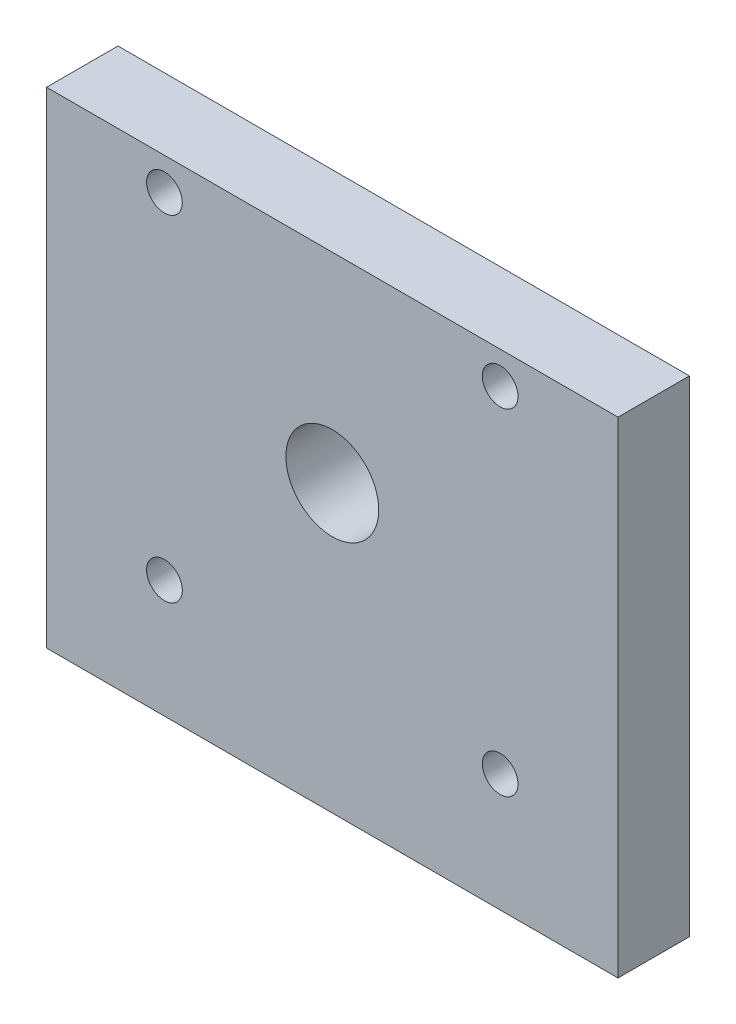
ISO-10303-21;
HEADER;
FILE_DESCRIPTION(('STEP AP214'),'2;1');
FILE_NAME('part.step','',(''),(''),'','','');
FILE_SCHEMA(('AUTOMOTIVE_DESIGN { 1 0 10303 214 1 1 1 1 }'));
ENDSEC;
DATA;
#1=APPLICATION_CONTEXT('core data for automotive mechanical design processes');
#2=APPLICATION_PROTOCOL_DEFINITION('international standard','automotive_design',2000,#1);
#3=PRODUCT_CONTEXT('',#1,'mechanical');
#4=PRODUCT('Part','Part','',(#3));
#5=PRODUCT_RELATED_PRODUCT_CATEGORY('part','',(#4));
#6=PRODUCT_DEFINITION_FORMATION('','',#4);
#7=PRODUCT_DEFINITION_CONTEXT('part definition',#1,'design');
#8=PRODUCT_DEFINITION('design','',#6,#7);
#9=PRODUCT_DEFINITION_SHAPE('','',#8);
#10=(LENGTH_UNIT() NAMED_UNIT(*) SI_UNIT(.MILLI.,.METRE.));
#11=(NAMED_UNIT(*) PLANE_ANGLE_UNIT() SI_UNIT($,.RADIAN.));
#12=(NAMED_UNIT(*) SI_UNIT($,.STERADIAN.) SOLID_ANGLE_UNIT());
#13=UNCERTAINTY_MEASURE_WITH_UNIT(LENGTH_MEASURE(1.E-05),#10,'distance_accuracy_value','');
#14=(GEOMETRIC_REPRESENTATION_CONTEXT(3) GLOBAL_UNCERTAINTY_ASSIGNED_CONTEXT((#13)) GLOBAL_UNIT_ASSIGNED_CONTEXT((#10,
#11,#12)) REPRESENTATION_CONTEXT('',''));
#15=CARTESIAN_POINT('',(0.,0.,0.));
#16=DIRECTION('',(0.,0.,1.));
#17=DIRECTION('',(1.,0.,0.));
#18=AXIS2_PLACEMENT_3D('',#15,#16,#17);
#19=CARTESIAN_POINT('',(0.,0.,10.));
#20=DIRECTION('',(0.,0.,1.));
#21=DIRECTION('',(1.,0.,0.));
#22=AXIS2_PLACEMENT_3D('',#19,#20,#21);
#23=PLANE('',#22);
#24=CARTESIAN_POINT('',(27.448018328344,-26.5684931506849,10.));
#25=DIRECTION('',(0.,0.,1.));
#26=DIRECTION('',(1.,0.,0.));
#27=AXIS2_PLACEMENT_3D('',#24,#25,#26);
#28=CIRCLE('',#27,2.5);
#29=CARTESIAN_POINT('',(29.948018328344,-26.5684931506849,10.));
#30=VERTEX_POINT('',#29);
#31=EDGE_CURVE('E128',#30,#30,#28,.T.);
#32=ORIENTED_EDGE('',*,*,#31,.F.);
#33=EDGE_LOOP('',(#32));
#34=FACE_BOUND('',#33,.T.);
#35=CARTESIAN_POINT('',(-19.5519816716559,20.4315068493151,10.));
#36=DIRECTION('',(0.,0.,1.));
#37=DIRECTION('',(1.,0.,0.));
#38=AXIS2_PLACEMENT_3D('',#35,#36,#37);
#39=CIRCLE('',#38,2.5);
#40=CARTESIAN_POINT('',(-17.0519816716559,20.4315068493151,10.));
#41=VERTEX_POINT('',#40);
#42=EDGE_CURVE('E116',#41,#41,#39,.T.);
#43=ORIENTED_EDGE('',*,*,#42,.F.);
#44=EDGE_LOOP('',(#43));
#45=FACE_BOUND('',#44,.T.);
#46=DIRECTION('',(0.,-1.,0.));
#47=VECTOR('',#46,1.);
#48=CARTESIAN_POINT('',(-36.0519816716559,24.9315068493151,10.));
#49=LINE('',#48,#47);
#50=CARTESIAN_POINT('',(-36.0519816716559,24.9315068493151,10.));
#51=VERTEX_POINT('',#50);
#52=CARTESIAN_POINT('',(-36.0519816716559,-43.0684931506849,10.));
#53=VERTEX_POINT('',#52);
#54=EDGE_CURVE('E86',#51,#53,#49,.T.);
#55=ORIENTED_EDGE('',*,*,#54,.T.);
#56=DIRECTION('',(1.,0.,0.));
#57=VECTOR('',#56,1.);
#58=CARTESIAN_POINT('',(-36.0519816716559,-43.0684931506849,10.));
#59=LINE('',#58,#57);
#60=CARTESIAN_POINT('',(43.9480183283441,-43.0684931506849,10.));
#61=VERTEX_POINT('',#60);
#62=EDGE_CURVE('E81',#53,#61,#59,.T.);
#63=ORIENTED_EDGE('',*,*,#62,.T.);
#64=DIRECTION('',(0.,1.,0.));
#65=VECTOR('',#64,1.);
#66=CARTESIAN_POINT('',(43.9480183283441,24.9315068493151,10.));
#67=LINE('',#66,#65);
#68=CARTESIAN_POINT('',(43.9480183283441,24.9315068493151,10.));
#69=VERTEX_POINT('',#68);
#70=EDGE_CURVE('E84',#61,#69,#67,.T.);
#71=ORIENTED_EDGE('',*,*,#70,.T.);
#72=DIRECTION('',(-1.,0.,0.));
#73=VECTOR('',#72,1.);
#74=CARTESIAN_POINT('',(-36.0519816716559,24.9315068493151,10.));
#75=LINE('',#74,#73);
#76=EDGE_CURVE('E51',#69,#51,#75,.T.);
#77=ORIENTED_EDGE('',*,*,#76,.T.);
#78=EDGE_LOOP('',(#55,#63,#71,#77));
#79=FACE_BOUND('',#78,.T.);
#80=CARTESIAN_POINT('',(3.94801832834409,-3.06849315068491,10.));
#81=DIRECTION('',(0.,0.,1.));
#82=DIRECTION('',(1.,0.,0.));
#83=AXIS2_PLACEMENT_3D('',#80,#81,#82);
#84=CIRCLE('',#83,6.5);
#85=CARTESIAN_POINT('',(10.4480183283441,-3.06849315068491,10.));
#86=VERTEX_POINT('',#85);
#87=EDGE_CURVE('E101',#86,#86,#84,.T.);
#88=ORIENTED_EDGE('',*,*,#87,.F.);
#89=EDGE_LOOP('',(#88));
#90=FACE_BOUND('',#89,.T.);
#91=CARTESIAN_POINT('',(27.448018328344,20.4315068493151,10.));
#92=DIRECTION('',(0.,0.,1.));
#93=DIRECTION('',(-1.,0.,0.));
#94=AXIS2_PLACEMENT_3D('',#91,#92,#93);
#95=CIRCLE('',#94,2.5);
#96=CARTESIAN_POINT('',(24.948018328344,20.4315068493151,10.));
#97=VERTEX_POINT('',#96);
#98=EDGE_CURVE('E122',#97,#97,#95,.T.);
#99=ORIENTED_EDGE('',*,*,#98,.F.);
#100=EDGE_LOOP('',(#99));
#101=FACE_BOUND('',#100,.T.);
#102=CARTESIAN_POINT('',(-19.5519816716559,-26.5684931506849,10.));
#103=DIRECTION('',(0.,0.,1.));
#104=DIRECTION('',(-1.,0.,0.));
#105=AXIS2_PLACEMENT_3D('',#102,#103,#104);
#106=CIRCLE('',#105,2.5);
#107=CARTESIAN_POINT('',(-22.0519816716559,-26.5684931506849,10.));
#108=VERTEX_POINT('',#107);
#109=EDGE_CURVE('E134',#108,#108,#106,.T.);
#110=ORIENTED_EDGE('',*,*,#109,.F.);
#111=EDGE_LOOP('',(#110));
#112=FACE_BOUND('',#111,.T.);
#113=ADVANCED_FACE('F34',(#34,#45,#79,#90,#101,#112),#23,.T.);
#114=CARTESIAN_POINT('',(0.,0.,0.));
#115=DIRECTION('',(0.,0.,1.));
#116=DIRECTION('',(1.,0.,0.));
#117=AXIS2_PLACEMENT_3D('',#114,#115,#116);
#118=PLANE('',#117);
#119=DIRECTION('',(0.,-1.,0.));
#120=VECTOR('',#119,1.);
#121=CARTESIAN_POINT('',(-36.0519816716559,24.9315068493151,0.));
#122=LINE('',#121,#120);
#123=CARTESIAN_POINT('',(-36.0519816716559,24.9315068493151,0.));
#124=VERTEX_POINT('',#123);
#125=CARTESIAN_POINT('',(-36.0519816716559,-43.0684931506849,0.));
#126=VERTEX_POINT('',#125);
#127=EDGE_CURVE('E98',#124,#126,#122,.T.);
#128=ORIENTED_EDGE('',*,*,#127,.F.);
#129=DIRECTION('',(-1.,0.,0.));
#130=VECTOR('',#129,1.);
#131=CARTESIAN_POINT('',(-36.0519816716559,24.9315068493151,0.));
#132=LINE('',#131,#130);
#133=CARTESIAN_POINT('',(43.9480183283441,24.9315068493151,0.));
#134=VERTEX_POINT('',#133);
#135=EDGE_CURVE('E74',#134,#124,#132,.T.);
#136=ORIENTED_EDGE('',*,*,#135,.F.);
#137=DIRECTION('',(0.,1.,0.));
#138=VECTOR('',#137,1.);
#139=CARTESIAN_POINT('',(43.9480183283441,24.9315068493151,0.));
#140=LINE('',#139,#138);
#141=CARTESIAN_POINT('',(43.9480183283441,-43.0684931506849,0.));
#142=VERTEX_POINT('',#141);
#143=EDGE_CURVE('E68',#142,#134,#140,.T.);
#144=ORIENTED_EDGE('',*,*,#143,.F.);
#145=DIRECTION('',(1.,0.,0.));
#146=VECTOR('',#145,1.);
#147=CARTESIAN_POINT('',(-36.0519816716559,-43.0684931506849,0.));
#148=LINE('',#147,#146);
#149=EDGE_CURVE('E90',#126,#142,#148,.T.);
#150=ORIENTED_EDGE('',*,*,#149,.F.);
#151=EDGE_LOOP('',(#128,#136,#144,#150));
#152=FACE_BOUND('',#151,.T.);
#153=CARTESIAN_POINT('',(3.94801832834409,-3.06849315068491,0.));
#154=DIRECTION('',(0.,0.,1.));
#155=DIRECTION('',(1.,0.,0.));
#156=AXIS2_PLACEMENT_3D('',#153,#154,#155);
#157=CIRCLE('',#156,6.5);
#158=CARTESIAN_POINT('',(10.4480183283441,-3.06849315068491,0.));
#159=VERTEX_POINT('',#158);
#160=EDGE_CURVE('E113',#159,#159,#157,.T.);
#161=ORIENTED_EDGE('',*,*,#160,.T.);
#162=EDGE_LOOP('',(#161));
#163=FACE_BOUND('',#162,.T.);
#164=CARTESIAN_POINT('',(-19.5519816716559,20.4315068493151,0.));
#165=DIRECTION('',(0.,0.,1.));
#166=DIRECTION('',(1.,0.,0.));
#167=AXIS2_PLACEMENT_3D('',#164,#165,#166);
#168=CIRCLE('',#167,2.5);
#169=CARTESIAN_POINT('',(-17.0519816716559,20.4315068493151,0.));
#170=VERTEX_POINT('',#169);
#171=EDGE_CURVE('E119',#170,#170,#168,.T.);
#172=ORIENTED_EDGE('',*,*,#171,.T.);
#173=EDGE_LOOP('',(#172));
#174=FACE_BOUND('',#173,.T.);
#175=CARTESIAN_POINT('',(27.448018328344,20.4315068493151,0.));
#176=DIRECTION('',(0.,0.,1.));
#177=DIRECTION('',(-1.,0.,0.));
#178=AXIS2_PLACEMENT_3D('',#175,#176,#177);
#179=CIRCLE('',#178,2.5);
#180=CARTESIAN_POINT('',(24.948018328344,20.4315068493151,0.));
#181=VERTEX_POINT('',#180);
#182=EDGE_CURVE('E125',#181,#181,#179,.T.);
#183=ORIENTED_EDGE('',*,*,#182,.T.);
#184=EDGE_LOOP('',(#183));
#185=FACE_BOUND('',#184,.T.);
#186=CARTESIAN_POINT('',(27.448018328344,-26.5684931506849,0.));
#187=DIRECTION('',(0.,0.,1.));
#188=DIRECTION('',(1.,0.,0.));
#189=AXIS2_PLACEMENT_3D('',#186,#187,#188);
#190=CIRCLE('',#189,2.5);
#191=CARTESIAN_POINT('',(29.948018328344,-26.5684931506849,0.));
#192=VERTEX_POINT('',#191);
#193=EDGE_CURVE('E131',#192,#192,#190,.T.);
#194=ORIENTED_EDGE('',*,*,#193,.T.);
#195=EDGE_LOOP('',(#194));
#196=FACE_BOUND('',#195,.T.);
#197=CARTESIAN_POINT('',(-19.5519816716559,-26.5684931506849,0.));
#198=DIRECTION('',(0.,0.,1.));
#199=DIRECTION('',(-1.,0.,0.));
#200=AXIS2_PLACEMENT_3D('',#197,#198,#199);
#201=CIRCLE('',#200,2.5);
#202=CARTESIAN_POINT('',(-22.0519816716559,-26.5684931506849,0.));
#203=VERTEX_POINT('',#202);
#204=EDGE_CURVE('E137',#203,#203,#201,.T.);
#205=ORIENTED_EDGE('',*,*,#204,.T.);
#206=EDGE_LOOP('',(#205));
#207=FACE_BOUND('',#206,.T.);
#208=ADVANCED_FACE('F109',(#152,#163,#174,#185,#196,#207),#118,.F.);
#209=CARTESIAN_POINT('',(-36.0519816716559,24.9315068493151,10.));
#210=DIRECTION('',(1.,0.,0.));
#211=DIRECTION('',(0.,1.,0.));
#212=AXIS2_PLACEMENT_3D('',#209,#210,#211);
#213=PLANE('',#212);
#214=ORIENTED_EDGE('',*,*,#127,.T.);
#215=DIRECTION('',(0.,0.,-1.));
#216=VECTOR('',#215,1.);
#217=CARTESIAN_POINT('',(-36.0519816716559,-43.0684931506849,10.));
#218=LINE('',#217,#216);
#219=EDGE_CURVE('E11',#53,#126,#218,.T.);
#220=ORIENTED_EDGE('',*,*,#219,.F.);
#221=ORIENTED_EDGE('',*,*,#54,.F.);
#222=DIRECTION('',(0.,0.,-1.));
#223=VECTOR('',#222,1.);
#224=CARTESIAN_POINT('',(-36.0519816716559,24.9315068493151,10.));
#225=LINE('',#224,#223);
#226=EDGE_CURVE('E94',#51,#124,#225,.T.);
#227=ORIENTED_EDGE('',*,*,#226,.T.);
#228=EDGE_LOOP('',(#214,#220,#221,#227));
#229=FACE_BOUND('',#228,.T.);
#230=ADVANCED_FACE('F36',(#229),#213,.F.);
#231=CARTESIAN_POINT('',(-36.0519816716559,-43.0684931506849,10.));
#232=DIRECTION('',(0.,1.,0.));
#233=DIRECTION('',(0.,0.,1.));
#234=AXIS2_PLACEMENT_3D('',#231,#232,#233);
#235=PLANE('',#234);
#236=ORIENTED_EDGE('',*,*,#149,.T.);
#237=DIRECTION('',(0.,0.,-1.));
#238=VECTOR('',#237,1.);
#239=CARTESIAN_POINT('',(43.9480183283441,-43.0684931506849,10.));
#240=LINE('',#239,#238);
#241=EDGE_CURVE('E43',#61,#142,#240,.T.);
#242=ORIENTED_EDGE('',*,*,#241,.F.);
#243=ORIENTED_EDGE('',*,*,#62,.F.);
#244=ORIENTED_EDGE('',*,*,#219,.T.);
#245=EDGE_LOOP('',(#236,#242,#243,#244));
#246=FACE_BOUND('',#245,.T.);
#247=ADVANCED_FACE('F89',(#246),#235,.F.);
#248=CARTESIAN_POINT('',(43.9480183283441,24.9315068493151,10.));
#249=DIRECTION('',(-1.,0.,0.));
#250=DIRECTION('',(0.,-1.,0.));
#251=AXIS2_PLACEMENT_3D('',#248,#249,#250);
#252=PLANE('',#251);
#253=ORIENTED_EDGE('',*,*,#143,.T.);
#254=DIRECTION('',(0.,0.,-1.));
#255=VECTOR('',#254,1.);
#256=CARTESIAN_POINT('',(43.9480183283441,24.9315068493151,10.));
#257=LINE('',#256,#255);
#258=EDGE_CURVE('E91',#69,#134,#257,.T.);
#259=ORIENTED_EDGE('',*,*,#258,.F.);
#260=ORIENTED_EDGE('',*,*,#70,.F.);
#261=ORIENTED_EDGE('',*,*,#241,.T.);
#262=EDGE_LOOP('',(#253,#259,#260,#261));
#263=FACE_BOUND('',#262,.T.);
#264=ADVANCED_FACE('F92',(#263),#252,.F.);
#265=CARTESIAN_POINT('',(-36.0519816716559,24.9315068493151,10.));
#266=DIRECTION('',(0.,-1.,0.));
#267=DIRECTION('',(0.,0.,-1.));
#268=AXIS2_PLACEMENT_3D('',#265,#266,#267);
#269=PLANE('',#268);
#270=ORIENTED_EDGE('',*,*,#135,.T.);
#271=ORIENTED_EDGE('',*,*,#226,.F.);
#272=ORIENTED_EDGE('',*,*,#76,.F.);
#273=ORIENTED_EDGE('',*,*,#258,.T.);
#274=EDGE_LOOP('',(#270,#271,#272,#273));
#275=FACE_BOUND('',#274,.T.);
#276=ADVANCED_FACE('F106',(#275),#269,.F.);
#277=CARTESIAN_POINT('',(3.94801832834409,-3.06849315068491,10.));
#278=DIRECTION('',(0.,0.,-1.));
#279=DIRECTION('',(-1.,0.,0.));
#280=AXIS2_PLACEMENT_3D('',#277,#278,#279);
#281=CYLINDRICAL_SURFACE('',#280,6.5);
#282=ORIENTED_EDGE('',*,*,#87,.T.);
#283=EDGE_LOOP('',(#282));
#284=FACE_BOUND('',#283,.T.);
#285=ORIENTED_EDGE('',*,*,#160,.F.);
#286=EDGE_LOOP('',(#285));
#287=FACE_BOUND('',#286,.T.);
#288=ADVANCED_FACE('F156',(#284,#287),#281,.F.);
#289=CARTESIAN_POINT('',(-19.5519816716559,20.4315068493151,10.));
#290=DIRECTION('',(0.,0.,-1.));
#291=DIRECTION('',(-1.,0.,0.));
#292=AXIS2_PLACEMENT_3D('',#289,#290,#291);
#293=CYLINDRICAL_SURFACE('',#292,2.5);
#294=ORIENTED_EDGE('',*,*,#42,.T.);
#295=EDGE_LOOP('',(#294));
#296=FACE_BOUND('',#295,.T.);
#297=ORIENTED_EDGE('',*,*,#171,.F.);
#298=EDGE_LOOP('',(#297));
#299=FACE_BOUND('',#298,.T.);
#300=ADVANCED_FACE('F202',(#296,#299),#293,.F.);
#301=CARTESIAN_POINT('',(27.448018328344,20.4315068493151,10.));
#302=DIRECTION('',(0.,0.,-1.));
#303=DIRECTION('',(-1.,0.,0.));
#304=AXIS2_PLACEMENT_3D('',#301,#302,#303);
#305=CYLINDRICAL_SURFACE('',#304,2.5);
#306=ORIENTED_EDGE('',*,*,#98,.T.);
#307=EDGE_LOOP('',(#306));
#308=FACE_BOUND('',#307,.T.);
#309=ORIENTED_EDGE('',*,*,#182,.F.);
#310=EDGE_LOOP('',(#309));
#311=FACE_BOUND('',#310,.T.);
#312=ADVANCED_FACE('F210',(#308,#311),#305,.F.);
#313=CARTESIAN_POINT('',(27.448018328344,-26.5684931506849,10.));
#314=DIRECTION('',(0.,0.,-1.));
#315=DIRECTION('',(-1.,0.,0.));
#316=AXIS2_PLACEMENT_3D('',#313,#314,#315);
#317=CYLINDRICAL_SURFACE('',#316,2.5);
#318=ORIENTED_EDGE('',*,*,#31,.T.);
#319=EDGE_LOOP('',(#318));
#320=FACE_BOUND('',#319,.T.);
#321=ORIENTED_EDGE('',*,*,#193,.F.);
#322=EDGE_LOOP('',(#321));
#323=FACE_BOUND('',#322,.T.);
#324=ADVANCED_FACE('F218',(#320,#323),#317,.F.);
#325=CARTESIAN_POINT('',(-19.5519816716559,-26.5684931506849,10.));
#326=DIRECTION('',(0.,0.,-1.));
#327=DIRECTION('',(-1.,0.,0.));
#328=AXIS2_PLACEMENT_3D('',#325,#326,#327);
#329=CYLINDRICAL_SURFACE('',#328,2.5);
#330=ORIENTED_EDGE('',*,*,#109,.T.);
#331=EDGE_LOOP('',(#330));
#332=FACE_BOUND('',#331,.T.);
#333=ORIENTED_EDGE('',*,*,#204,.F.);
#334=EDGE_LOOP('',(#333));
#335=FACE_BOUND('',#334,.T.);
#336=ADVANCED_FACE('F143',(#332,#335),#329,.F.);
#337=CLOSED_SHELL('',(#113,#208,#230,#247,#264,#276,#288,#300,#312,#324,#336));
#338=MANIFOLD_SOLID_BREP('B2',#337);
#339=ADVANCED_BREP_SHAPE_REPRESENTATION('',(#18,#338),#14);
#340=SHAPE_DEFINITION_REPRESENTATION(#9,#339);
ENDSEC;
END-ISO-10303-21;
